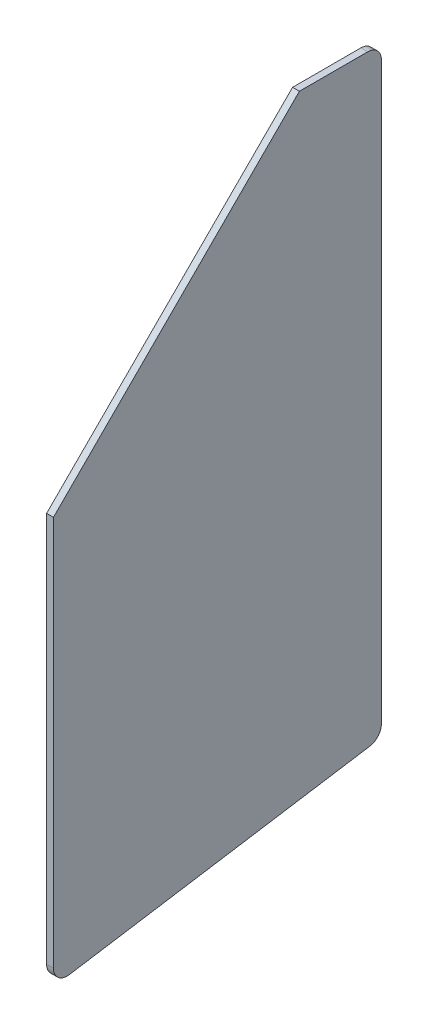
ISO-10303-21;
HEADER;
FILE_DESCRIPTION(('STEP AP214'),'2;1');
FILE_NAME('part.step','',(''),(''),'','','');
FILE_SCHEMA(('AUTOMOTIVE_DESIGN { 1 0 10303 214 1 1 1 1 }'));
ENDSEC;
DATA;
#1=APPLICATION_CONTEXT('core data for automotive mechanical design processes');
#2=APPLICATION_PROTOCOL_DEFINITION('international standard','automotive_design',2000,#1);
#3=PRODUCT_CONTEXT('',#1,'mechanical');
#4=PRODUCT('Part','Part','',(#3));
#5=PRODUCT_RELATED_PRODUCT_CATEGORY('part','',(#4));
#6=PRODUCT_DEFINITION_FORMATION('','',#4);
#7=PRODUCT_DEFINITION_CONTEXT('part definition',#1,'design');
#8=PRODUCT_DEFINITION('design','',#6,#7);
#9=PRODUCT_DEFINITION_SHAPE('','',#8);
#10=(LENGTH_UNIT() NAMED_UNIT(*) SI_UNIT(.MILLI.,.METRE.));
#11=(NAMED_UNIT(*) PLANE_ANGLE_UNIT() SI_UNIT($,.RADIAN.));
#12=(NAMED_UNIT(*) SI_UNIT($,.STERADIAN.) SOLID_ANGLE_UNIT());
#13=UNCERTAINTY_MEASURE_WITH_UNIT(LENGTH_MEASURE(1.E-05),#10,'distance_accuracy_value','');
#14=(GEOMETRIC_REPRESENTATION_CONTEXT(3) GLOBAL_UNCERTAINTY_ASSIGNED_CONTEXT((#13)) GLOBAL_UNIT_ASSIGNED_CONTEXT((#10,
#11,#12)) REPRESENTATION_CONTEXT('',''));
#15=CARTESIAN_POINT('',(0.,0.,0.));
#16=DIRECTION('',(0.,0.,1.));
#17=DIRECTION('',(1.,0.,0.));
#18=AXIS2_PLACEMENT_3D('',#15,#16,#17);
#19=CARTESIAN_POINT('',(0.,0.,0.));
#20=DIRECTION('',(1.,0.,0.));
#21=DIRECTION('',(0.,0.,-1.));
#22=AXIS2_PLACEMENT_3D('',#19,#20,#21);
#23=PLANE('',#22);
#24=CARTESIAN_POINT('',(0.,-122.04504894185,-69.85));
#25=DIRECTION('',(-1.,0.,0.));
#26=DIRECTION('',(0.,0.,1.));
#27=AXIS2_PLACEMENT_3D('',#24,#25,#26);
#28=CIRCLE('',#27,6.35);
#29=CARTESIAN_POINT('',(0.,-128.316869904631,-70.8433588530045));
#30=VERTEX_POINT('',#29);
#31=CARTESIAN_POINT('',(0.,-122.04504894185,-76.2));
#32=VERTEX_POINT('',#31);
#33=EDGE_CURVE('E142',#30,#32,#28,.F.);
#34=ORIENTED_EDGE('',*,*,#33,.F.);
#35=DIRECTION('',(0.,-0.156434465040207,0.987688340595142));
#36=VECTOR('',#35,1.);
#37=CARTESIAN_POINT('',(0.,-127.468461294546,-76.2));
#38=LINE('',#37,#36);
#39=CARTESIAN_POINT('',(0.,-150.443176217967,68.856641146996));
#40=VERTEX_POINT('',#39);
#41=EDGE_CURVE('E127',#30,#40,#38,.T.);
#42=ORIENTED_EDGE('',*,*,#41,.T.);
#43=CARTESIAN_POINT('',(0.,-144.171355255189,69.85));
#44=DIRECTION('',(1.,0.,0.));
#45=DIRECTION('',(0.,0.,-1.));
#46=AXIS2_PLACEMENT_3D('',#43,#44,#45);
#47=CIRCLE('',#46,6.35);
#48=CARTESIAN_POINT('',(0.,-144.171355255189,76.2));
#49=VERTEX_POINT('',#48);
#50=EDGE_CURVE('E20',#49,#40,#47,.T.);
#51=ORIENTED_EDGE('',*,*,#50,.F.);
#52=DIRECTION('',(0.,1.,0.));
#53=VECTOR('',#52,1.);
#54=CARTESIAN_POINT('',(0.,151.60625,76.2));
#55=LINE('',#54,#53);
#56=CARTESIAN_POINT('',(0.,37.30625,76.2));
#57=VERTEX_POINT('',#56);
#58=EDGE_CURVE('E73',#57,#49,#55,.F.);
#59=ORIENTED_EDGE('',*,*,#58,.F.);
#60=DIRECTION('',(0.,0.707106781186548,-0.707106781186548));
#61=VECTOR('',#60,1.);
#62=CARTESIAN_POINT('',(0.,37.30625,76.2));
#63=LINE('',#62,#61);
#64=CARTESIAN_POINT('',(0.,151.60625,-38.1));
#65=VERTEX_POINT('',#64);
#66=EDGE_CURVE('E81',#57,#65,#63,.T.);
#67=ORIENTED_EDGE('',*,*,#66,.T.);
#68=DIRECTION('',(0.,0.,1.));
#69=VECTOR('',#68,1.);
#70=CARTESIAN_POINT('',(0.,151.60625,-76.2));
#71=LINE('',#70,#69);
#72=CARTESIAN_POINT('',(0.,151.60625,-69.85));
#73=VERTEX_POINT('',#72);
#74=EDGE_CURVE('E122',#73,#65,#71,.T.);
#75=ORIENTED_EDGE('',*,*,#74,.F.);
#76=CARTESIAN_POINT('',(0.,145.25625,-69.85));
#77=DIRECTION('',(-1.,0.,0.));
#78=DIRECTION('',(0.,0.,1.));
#79=AXIS2_PLACEMENT_3D('',#76,#77,#78);
#80=CIRCLE('',#79,6.35);
#81=CARTESIAN_POINT('',(0.,145.25625,-76.2));
#82=VERTEX_POINT('',#81);
#83=EDGE_CURVE('E108',#82,#73,#80,.F.);
#84=ORIENTED_EDGE('',*,*,#83,.F.);
#85=DIRECTION('',(0.,1.,0.));
#86=VECTOR('',#85,1.);
#87=CARTESIAN_POINT('',(0.,-151.60625,-76.2));
#88=LINE('',#87,#86);
#89=EDGE_CURVE('E118',#32,#82,#88,.T.);
#90=ORIENTED_EDGE('',*,*,#89,.F.);
#91=EDGE_LOOP('',(#34,#42,#51,#59,#67,#75,#84,#90));
#92=FACE_BOUND('',#91,.T.);
#93=ADVANCED_FACE('F17',(#92),#23,.F.);
#94=CARTESIAN_POINT('',(0.,151.60625,-76.2));
#95=DIRECTION('',(0.,1.,0.));
#96=DIRECTION('',(0.,0.,1.));
#97=AXIS2_PLACEMENT_3D('',#94,#95,#96);
#98=PLANE('',#97);
#99=DIRECTION('',(0.,0.,-1.));
#100=VECTOR('',#99,1.);
#101=CARTESIAN_POINT('',(3.175,151.60625,0.));
#102=LINE('',#101,#100);
#103=CARTESIAN_POINT('',(3.175,151.60625,-69.85));
#104=VERTEX_POINT('',#103);
#105=CARTESIAN_POINT('',(3.175,151.60625,-38.1));
#106=VERTEX_POINT('',#105);
#107=EDGE_CURVE('E106',#104,#106,#102,.F.);
#108=ORIENTED_EDGE('',*,*,#107,.F.);
#109=DIRECTION('',(-1.,0.,0.));
#110=VECTOR('',#109,1.);
#111=CARTESIAN_POINT('',(11.13155,151.60625,-69.85));
#112=LINE('',#111,#110);
#113=EDGE_CURVE('E120',#73,#104,#112,.F.);
#114=ORIENTED_EDGE('',*,*,#113,.F.);
#115=ORIENTED_EDGE('',*,*,#74,.T.);
#116=DIRECTION('',(1.,0.,0.));
#117=VECTOR('',#116,1.);
#118=CARTESIAN_POINT('',(3.175,151.60625,-38.1));
#119=LINE('',#118,#117);
#120=EDGE_CURVE('E92',#65,#106,#119,.T.);
#121=ORIENTED_EDGE('',*,*,#120,.T.);
#122=EDGE_LOOP('',(#108,#114,#115,#121));
#123=FACE_BOUND('',#122,.T.);
#124=ADVANCED_FACE('F239',(#123),#98,.T.);
#125=CARTESIAN_POINT('',(3.175,37.30625,76.2));
#126=DIRECTION('',(0.,-0.707106781186548,-0.707106781186548));
#127=DIRECTION('',(0.,0.707106781186548,-0.707106781186548));
#128=AXIS2_PLACEMENT_3D('',#125,#126,#127);
#129=PLANE('',#128);
#130=DIRECTION('',(0.,-0.707106781186548,0.707106781186547));
#131=VECTOR('',#130,1.);
#132=CARTESIAN_POINT('',(3.175,151.60625,-38.1));
#133=LINE('',#132,#131);
#134=CARTESIAN_POINT('',(3.175,37.30625,76.2));
#135=VERTEX_POINT('',#134);
#136=EDGE_CURVE('E90',#106,#135,#133,.T.);
#137=ORIENTED_EDGE('',*,*,#136,.F.);
#138=ORIENTED_EDGE('',*,*,#120,.F.);
#139=ORIENTED_EDGE('',*,*,#66,.F.);
#140=DIRECTION('',(1.,0.,0.));
#141=VECTOR('',#140,1.);
#142=CARTESIAN_POINT('',(0.,37.30625,76.2));
#143=LINE('',#142,#141);
#144=EDGE_CURVE('E86',#135,#57,#143,.F.);
#145=ORIENTED_EDGE('',*,*,#144,.F.);
#146=EDGE_LOOP('',(#137,#138,#139,#145));
#147=FACE_BOUND('',#146,.T.);
#148=ADVANCED_FACE('F88',(#147),#129,.F.);
#149=CARTESIAN_POINT('',(0.,151.60625,76.2));
#150=DIRECTION('',(0.,0.,1.));
#151=DIRECTION('',(1.,0.,0.));
#152=AXIS2_PLACEMENT_3D('',#149,#150,#151);
#153=PLANE('',#152);
#154=ORIENTED_EDGE('',*,*,#58,.T.);
#155=DIRECTION('',(1.,0.,0.));
#156=VECTOR('',#155,1.);
#157=CARTESIAN_POINT('',(-7.95655,-144.171355255189,76.2));
#158=LINE('',#157,#156);
#159=CARTESIAN_POINT('',(3.175,-144.171355255189,76.2));
#160=VERTEX_POINT('',#159);
#161=EDGE_CURVE('E98',#160,#49,#158,.F.);
#162=ORIENTED_EDGE('',*,*,#161,.F.);
#163=DIRECTION('',(0.,1.,0.));
#164=VECTOR('',#163,1.);
#165=CARTESIAN_POINT('',(3.175,0.,76.2));
#166=LINE('',#165,#164);
#167=EDGE_CURVE('E95',#135,#160,#166,.F.);
#168=ORIENTED_EDGE('',*,*,#167,.F.);
#169=ORIENTED_EDGE('',*,*,#144,.T.);
#170=EDGE_LOOP('',(#154,#162,#168,#169));
#171=FACE_BOUND('',#170,.T.);
#172=ADVANCED_FACE('F96',(#171),#153,.T.);
#173=CARTESIAN_POINT('',(-7.95655,-144.171355255189,69.85));
#174=DIRECTION('',(1.,0.,0.));
#175=DIRECTION('',(0.,0.,-1.));
#176=AXIS2_PLACEMENT_3D('',#173,#174,#175);
#177=CYLINDRICAL_SURFACE('',#176,6.35);
#178=DIRECTION('',(1.,0.,0.));
#179=VECTOR('',#178,1.);
#180=CARTESIAN_POINT('',(3.175,-150.443176217967,68.8566411469971));
#181=LINE('',#180,#179);
#182=CARTESIAN_POINT('',(3.175,-150.44317621797,68.8566411469954));
#183=VERTEX_POINT('',#182);
#184=EDGE_CURVE('E129',#40,#183,#181,.T.);
#185=ORIENTED_EDGE('',*,*,#184,.T.);
#186=CARTESIAN_POINT('',(3.175,-144.171355255189,69.85));
#187=DIRECTION('',(1.,0.,0.));
#188=DIRECTION('',(0.,0.,-1.));
#189=AXIS2_PLACEMENT_3D('',#186,#187,#188);
#190=CIRCLE('',#189,6.35);
#191=EDGE_CURVE('E102',#160,#183,#190,.T.);
#192=ORIENTED_EDGE('',*,*,#191,.F.);
#193=ORIENTED_EDGE('',*,*,#161,.T.);
#194=ORIENTED_EDGE('',*,*,#50,.T.);
#195=EDGE_LOOP('',(#185,#192,#193,#194));
#196=FACE_BOUND('',#195,.T.);
#197=ADVANCED_FACE('F158',(#196),#177,.T.);
#198=CARTESIAN_POINT('',(3.175,-127.468461294546,-76.2));
#199=DIRECTION('',(0.,0.987688340595142,0.156434465040207));
#200=DIRECTION('',(0.,-0.156434465040207,0.987688340595142));
#201=AXIS2_PLACEMENT_3D('',#198,#199,#200);
#202=PLANE('',#201);
#203=ORIENTED_EDGE('',*,*,#184,.F.);
#204=ORIENTED_EDGE('',*,*,#41,.F.);
#205=DIRECTION('',(-1.,0.,0.));
#206=VECTOR('',#205,1.);
#207=CARTESIAN_POINT('',(11.13155,-128.316869904629,-70.8433588530032));
#208=LINE('',#207,#206);
#209=CARTESIAN_POINT('',(3.175,-128.316869904632,-70.8433588530047));
#210=VERTEX_POINT('',#209);
#211=EDGE_CURVE('E143',#210,#30,#208,.T.);
#212=ORIENTED_EDGE('',*,*,#211,.F.);
#213=DIRECTION('',(0.,0.15643446504024,-0.987688340595136));
#214=VECTOR('',#213,1.);
#215=CARTESIAN_POINT('',(3.175,-150.443176217973,68.856641146996));
#216=LINE('',#215,#214);
#217=EDGE_CURVE('E139',#183,#210,#216,.T.);
#218=ORIENTED_EDGE('',*,*,#217,.F.);
#219=EDGE_LOOP('',(#203,#204,#212,#218));
#220=FACE_BOUND('',#219,.T.);
#221=ADVANCED_FACE('F162',(#220),#202,.F.);
#222=CARTESIAN_POINT('',(11.13155,-122.04504894185,-69.85));
#223=DIRECTION('',(-1.,0.,0.));
#224=DIRECTION('',(0.,0.,1.));
#225=AXIS2_PLACEMENT_3D('',#222,#223,#224);
#226=CYLINDRICAL_SURFACE('',#225,6.35);
#227=ORIENTED_EDGE('',*,*,#211,.T.);
#228=ORIENTED_EDGE('',*,*,#33,.T.);
#229=DIRECTION('',(-1.,0.,0.));
#230=VECTOR('',#229,1.);
#231=CARTESIAN_POINT('',(0.,-122.04504894185,-76.2));
#232=LINE('',#231,#230);
#233=CARTESIAN_POINT('',(3.175,-122.04504894185,-76.2));
#234=VERTEX_POINT('',#233);
#235=EDGE_CURVE('E121',#234,#32,#232,.T.);
#236=ORIENTED_EDGE('',*,*,#235,.F.);
#237=CARTESIAN_POINT('',(3.175,-122.04504894185,-69.85));
#238=DIRECTION('',(-1.,0.,0.));
#239=DIRECTION('',(0.,0.,1.));
#240=AXIS2_PLACEMENT_3D('',#237,#238,#239);
#241=CIRCLE('',#240,6.35);
#242=EDGE_CURVE('E136',#210,#234,#241,.F.);
#243=ORIENTED_EDGE('',*,*,#242,.F.);
#244=EDGE_LOOP('',(#227,#228,#236,#243));
#245=FACE_BOUND('',#244,.T.);
#246=ADVANCED_FACE('F177',(#245),#226,.T.);
#247=CARTESIAN_POINT('',(0.,-151.60625,-76.2));
#248=DIRECTION('',(0.,0.,-1.));
#249=DIRECTION('',(-1.,0.,0.));
#250=AXIS2_PLACEMENT_3D('',#247,#248,#249);
#251=PLANE('',#250);
#252=ORIENTED_EDGE('',*,*,#89,.T.);
#253=DIRECTION('',(-1.,0.,0.));
#254=VECTOR('',#253,1.);
#255=CARTESIAN_POINT('',(11.13155,145.25625,-76.2));
#256=LINE('',#255,#254);
#257=CARTESIAN_POINT('',(3.175,145.25625,-76.2));
#258=VERTEX_POINT('',#257);
#259=EDGE_CURVE('E35',#258,#82,#256,.T.);
#260=ORIENTED_EDGE('',*,*,#259,.F.);
#261=DIRECTION('',(0.,1.,0.));
#262=VECTOR('',#261,1.);
#263=CARTESIAN_POINT('',(3.175,0.,-76.2));
#264=LINE('',#263,#262);
#265=EDGE_CURVE('E26',#234,#258,#264,.T.);
#266=ORIENTED_EDGE('',*,*,#265,.F.);
#267=ORIENTED_EDGE('',*,*,#235,.T.);
#268=EDGE_LOOP('',(#252,#260,#266,#267));
#269=FACE_BOUND('',#268,.T.);
#270=ADVANCED_FACE('F176',(#269),#251,.T.);
#271=CARTESIAN_POINT('',(11.13155,145.25625,-69.85));
#272=DIRECTION('',(-1.,0.,0.));
#273=DIRECTION('',(0.,0.,1.));
#274=AXIS2_PLACEMENT_3D('',#271,#272,#273);
#275=CYLINDRICAL_SURFACE('',#274,6.35);
#276=ORIENTED_EDGE('',*,*,#259,.T.);
#277=ORIENTED_EDGE('',*,*,#83,.T.);
#278=ORIENTED_EDGE('',*,*,#113,.T.);
#279=CARTESIAN_POINT('',(3.175,145.25625,-69.85));
#280=DIRECTION('',(-1.,0.,0.));
#281=DIRECTION('',(0.,0.,1.));
#282=AXIS2_PLACEMENT_3D('',#279,#280,#281);
#283=CIRCLE('',#282,6.35);
#284=EDGE_CURVE('E11',#258,#104,#283,.F.);
#285=ORIENTED_EDGE('',*,*,#284,.F.);
#286=EDGE_LOOP('',(#276,#277,#278,#285));
#287=FACE_BOUND('',#286,.T.);
#288=ADVANCED_FACE('F173',(#287),#275,.T.);
#289=CARTESIAN_POINT('',(3.175,0.,0.));
#290=DIRECTION('',(1.,0.,0.));
#291=DIRECTION('',(0.,0.,-1.));
#292=AXIS2_PLACEMENT_3D('',#289,#290,#291);
#293=PLANE('',#292);
#294=ORIENTED_EDGE('',*,*,#265,.T.);
#295=ORIENTED_EDGE('',*,*,#284,.T.);
#296=ORIENTED_EDGE('',*,*,#107,.T.);
#297=ORIENTED_EDGE('',*,*,#136,.T.);
#298=ORIENTED_EDGE('',*,*,#167,.T.);
#299=ORIENTED_EDGE('',*,*,#191,.T.);
#300=ORIENTED_EDGE('',*,*,#217,.T.);
#301=ORIENTED_EDGE('',*,*,#242,.T.);
#302=EDGE_LOOP('',(#294,#295,#296,#297,#298,#299,#300,#301));
#303=FACE_BOUND('',#302,.T.);
#304=ADVANCED_FACE('F105',(#303),#293,.T.);
#305=CLOSED_SHELL('',(#93,#124,#148,#172,#197,#221,#246,#270,#288,#304));
#306=MANIFOLD_SOLID_BREP('B1',#305);
#307=ADVANCED_BREP_SHAPE_REPRESENTATION('',(#18,#306),#14);
#308=SHAPE_DEFINITION_REPRESENTATION(#9,#307);
ENDSEC;
END-ISO-10303-21;
